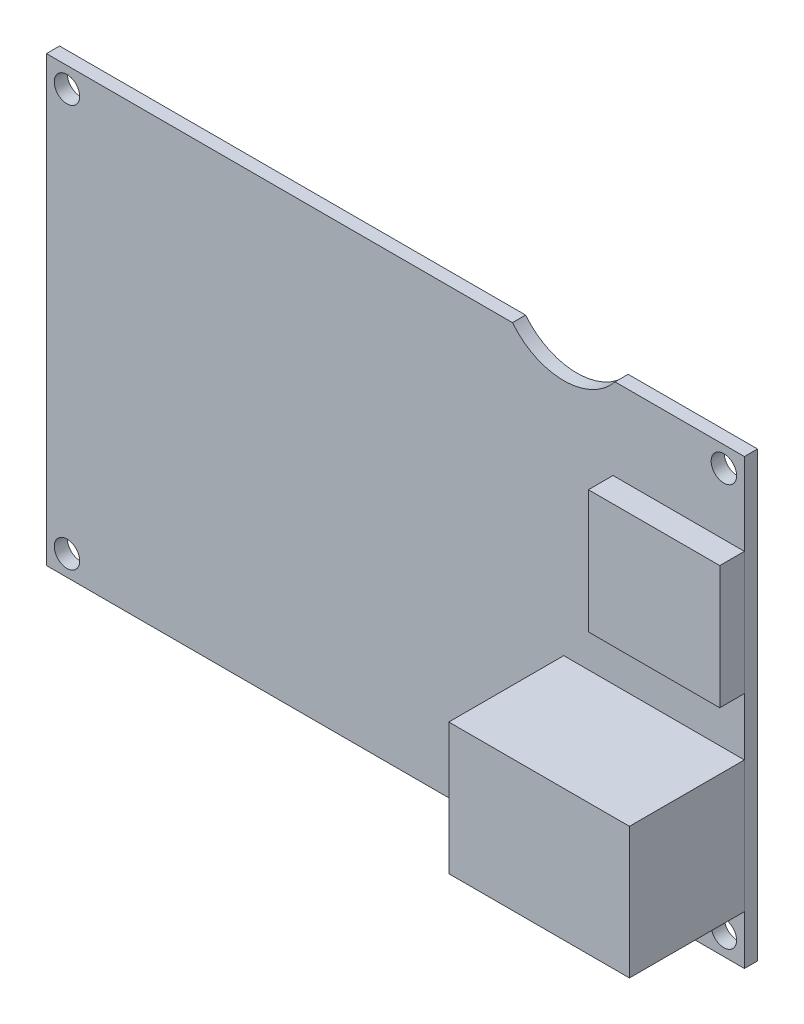
ISO-10303-21;
HEADER;
FILE_DESCRIPTION(('STEP AP214'),'2;1');
FILE_NAME('part.step','',(''),(''),'','','');
FILE_SCHEMA(('AUTOMOTIVE_DESIGN { 1 0 10303 214 1 1 1 1 }'));
ENDSEC;
DATA;
#1=APPLICATION_CONTEXT('core data for automotive mechanical design processes');
#2=APPLICATION_PROTOCOL_DEFINITION('international standard','automotive_design',2000,#1);
#3=PRODUCT_CONTEXT('',#1,'mechanical');
#4=PRODUCT('Part','Part','',(#3));
#5=PRODUCT_RELATED_PRODUCT_CATEGORY('part','',(#4));
#6=PRODUCT_DEFINITION_FORMATION('','',#4);
#7=PRODUCT_DEFINITION_CONTEXT('part definition',#1,'design');
#8=PRODUCT_DEFINITION('design','',#6,#7);
#9=PRODUCT_DEFINITION_SHAPE('','',#8);
#10=(LENGTH_UNIT() NAMED_UNIT(*) SI_UNIT(.MILLI.,.METRE.));
#11=(NAMED_UNIT(*) PLANE_ANGLE_UNIT() SI_UNIT($,.RADIAN.));
#12=(NAMED_UNIT(*) SI_UNIT($,.STERADIAN.) SOLID_ANGLE_UNIT());
#13=UNCERTAINTY_MEASURE_WITH_UNIT(LENGTH_MEASURE(1.E-05),#10,'distance_accuracy_value','');
#14=(GEOMETRIC_REPRESENTATION_CONTEXT(3) GLOBAL_UNCERTAINTY_ASSIGNED_CONTEXT((#13)) GLOBAL_UNIT_ASSIGNED_CONTEXT((#10,
#11,#12)) REPRESENTATION_CONTEXT('',''));
#15=CARTESIAN_POINT('',(0.,0.,0.));
#16=DIRECTION('',(0.,0.,1.));
#17=DIRECTION('',(1.,0.,0.));
#18=AXIS2_PLACEMENT_3D('',#15,#16,#17);
#19=CARTESIAN_POINT('',(69.,-51.469609130499,4.6));
#20=DIRECTION('',(-1.,0.,0.));
#21=DIRECTION('',(0.,0.,1.));
#22=AXIS2_PLACEMENT_3D('',#19,#20,#21);
#23=PLANE('',#22);
#24=DIRECTION('',(0.,1.,0.));
#25=VECTOR('',#24,1.);
#26=CARTESIAN_POINT('',(69.,-51.469609130499,1.6));
#27=LINE('',#26,#25);
#28=CARTESIAN_POINT('',(69.,29.,1.6));
#29=VERTEX_POINT('',#28);
#30=CARTESIAN_POINT('',(69.,44.,1.6));
#31=VERTEX_POINT('',#30);
#32=EDGE_CURVE('E108',#29,#31,#27,.T.);
#33=ORIENTED_EDGE('',*,*,#32,.F.);
#34=DIRECTION('',(0.,0.,-1.));
#35=VECTOR('',#34,1.);
#36=CARTESIAN_POINT('',(69.,29.,4.6));
#37=LINE('',#36,#35);
#38=CARTESIAN_POINT('',(69.,29.,4.6));
#39=VERTEX_POINT('',#38);
#40=EDGE_CURVE('E12',#39,#29,#37,.T.);
#41=ORIENTED_EDGE('',*,*,#40,.F.);
#42=DIRECTION('',(0.,1.,0.));
#43=VECTOR('',#42,1.);
#44=CARTESIAN_POINT('',(69.,-51.469609130499,4.6));
#45=LINE('',#44,#43);
#46=CARTESIAN_POINT('',(69.,44.,4.6));
#47=VERTEX_POINT('',#46);
#48=EDGE_CURVE('E102',#39,#47,#45,.T.);
#49=ORIENTED_EDGE('',*,*,#48,.T.);
#50=DIRECTION('',(0.,0.,-1.));
#51=VECTOR('',#50,1.);
#52=CARTESIAN_POINT('',(69.,44.,4.6));
#53=LINE('',#52,#51);
#54=EDGE_CURVE('E83',#47,#31,#53,.T.);
#55=ORIENTED_EDGE('',*,*,#54,.T.);
#56=EDGE_LOOP('',(#33,#41,#49,#55));
#57=FACE_BOUND('',#56,.T.);
#58=ADVANCED_FACE('F45',(#57),#23,.T.);
#59=CARTESIAN_POINT('',(42.5,29.,4.6));
#60=DIRECTION('',(0.,-1.,0.));
#61=DIRECTION('',(0.,0.,-1.));
#62=AXIS2_PLACEMENT_3D('',#59,#60,#61);
#63=PLANE('',#62);
#64=DIRECTION('',(-1.,0.,0.));
#65=VECTOR('',#64,1.);
#66=CARTESIAN_POINT('',(42.5,29.,1.6));
#67=LINE('',#66,#65);
#68=CARTESIAN_POINT('',(85.,29.,1.6));
#69=VERTEX_POINT('',#68);
#70=EDGE_CURVE('E96',#69,#29,#67,.T.);
#71=ORIENTED_EDGE('',*,*,#70,.F.);
#72=DIRECTION('',(0.,0.,-1.));
#73=VECTOR('',#72,1.);
#74=CARTESIAN_POINT('',(85.,29.,4.6));
#75=LINE('',#74,#73);
#76=CARTESIAN_POINT('',(85.,29.,4.6));
#77=VERTEX_POINT('',#76);
#78=EDGE_CURVE('E53',#77,#69,#75,.T.);
#79=ORIENTED_EDGE('',*,*,#78,.F.);
#80=DIRECTION('',(-1.,0.,0.));
#81=VECTOR('',#80,1.);
#82=CARTESIAN_POINT('',(42.5,29.,4.6));
#83=LINE('',#82,#81);
#84=EDGE_CURVE('E94',#77,#39,#83,.T.);
#85=ORIENTED_EDGE('',*,*,#84,.T.);
#86=ORIENTED_EDGE('',*,*,#40,.T.);
#87=EDGE_LOOP('',(#71,#79,#85,#86));
#88=FACE_BOUND('',#87,.T.);
#89=ADVANCED_FACE('F92',(#88),#63,.T.);
#90=CARTESIAN_POINT('',(85.,-51.469609130499,4.6));
#91=DIRECTION('',(-1.,0.,0.));
#92=DIRECTION('',(0.,0.,1.));
#93=AXIS2_PLACEMENT_3D('',#90,#91,#92);
#94=PLANE('',#93);
#95=DIRECTION('',(0.,1.,0.));
#96=VECTOR('',#95,1.);
#97=CARTESIAN_POINT('',(85.,-51.469609130499,1.6));
#98=LINE('',#97,#96);
#99=CARTESIAN_POINT('',(85.,44.,1.6));
#100=VERTEX_POINT('',#99);
#101=EDGE_CURVE('E76',#69,#100,#98,.T.);
#102=ORIENTED_EDGE('',*,*,#101,.T.);
#103=DIRECTION('',(0.,0.,-1.));
#104=VECTOR('',#103,1.);
#105=CARTESIAN_POINT('',(85.,44.,4.6));
#106=LINE('',#105,#104);
#107=CARTESIAN_POINT('',(85.,44.,4.6));
#108=VERTEX_POINT('',#107);
#109=EDGE_CURVE('E97',#108,#100,#106,.T.);
#110=ORIENTED_EDGE('',*,*,#109,.F.);
#111=DIRECTION('',(0.,1.,0.));
#112=VECTOR('',#111,1.);
#113=CARTESIAN_POINT('',(85.,-51.469609130499,4.6));
#114=LINE('',#113,#112);
#115=EDGE_CURVE('E98',#77,#108,#114,.T.);
#116=ORIENTED_EDGE('',*,*,#115,.F.);
#117=ORIENTED_EDGE('',*,*,#78,.T.);
#118=EDGE_LOOP('',(#102,#110,#116,#117));
#119=FACE_BOUND('',#118,.T.);
#120=ADVANCED_FACE('F99',(#119),#94,.F.);
#121=CARTESIAN_POINT('',(42.5,44.,4.6));
#122=DIRECTION('',(0.,-1.,0.));
#123=DIRECTION('',(0.,0.,-1.));
#124=AXIS2_PLACEMENT_3D('',#121,#122,#123);
#125=PLANE('',#124);
#126=DIRECTION('',(-1.,0.,0.));
#127=VECTOR('',#126,1.);
#128=CARTESIAN_POINT('',(42.5,44.,1.6));
#129=LINE('',#128,#127);
#130=EDGE_CURVE('E104',#100,#31,#129,.T.);
#131=ORIENTED_EDGE('',*,*,#130,.T.);
#132=ORIENTED_EDGE('',*,*,#54,.F.);
#133=DIRECTION('',(-1.,0.,0.));
#134=VECTOR('',#133,1.);
#135=CARTESIAN_POINT('',(42.5,44.,4.6));
#136=LINE('',#135,#134);
#137=EDGE_CURVE('E61',#108,#47,#136,.T.);
#138=ORIENTED_EDGE('',*,*,#137,.F.);
#139=ORIENTED_EDGE('',*,*,#109,.T.);
#140=EDGE_LOOP('',(#131,#132,#138,#139));
#141=FACE_BOUND('',#140,.T.);
#142=ADVANCED_FACE('F117',(#141),#125,.F.);
#143=CARTESIAN_POINT('',(42.5,-51.469609130499,4.6));
#144=DIRECTION('',(0.,0.,1.));
#145=DIRECTION('',(1.,0.,0.));
#146=AXIS2_PLACEMENT_3D('',#143,#144,#145);
#147=PLANE('',#146);
#148=ORIENTED_EDGE('',*,*,#48,.F.);
#149=ORIENTED_EDGE('',*,*,#84,.F.);
#150=ORIENTED_EDGE('',*,*,#115,.T.);
#151=ORIENTED_EDGE('',*,*,#137,.T.);
#152=EDGE_LOOP('',(#148,#149,#150,#151));
#153=FACE_BOUND('',#152,.T.);
#154=ADVANCED_FACE('F101',(#153),#147,.T.);
#155=CARTESIAN_POINT('',(42.5,-51.469609130499,1.6));
#156=DIRECTION('',(0.,0.,1.));
#157=DIRECTION('',(1.,0.,0.));
#158=AXIS2_PLACEMENT_3D('',#155,#156,#157);
#159=PLANE('',#158);
#160=ORIENTED_EDGE('',*,*,#32,.T.);
#161=ORIENTED_EDGE('',*,*,#130,.F.);
#162=ORIENTED_EDGE('',*,*,#101,.F.);
#163=ORIENTED_EDGE('',*,*,#70,.T.);
#164=EDGE_LOOP('',(#160,#161,#162,#163));
#165=FACE_BOUND('',#164,.T.);
#166=ADVANCED_FACE('F119',(#165),#159,.F.);
#167=CLOSED_SHELL('',(#58,#89,#120,#142,#154,#166));
#168=MANIFOLD_SOLID_BREP('B2',#167);
#169=CARTESIAN_POINT('',(63.,-51.469609130499,15.6));
#170=DIRECTION('',(-1.,0.,0.));
#171=DIRECTION('',(0.,0.,1.));
#172=AXIS2_PLACEMENT_3D('',#169,#170,#171);
#173=PLANE('',#172);
#174=DIRECTION('',(0.,1.,0.));
#175=VECTOR('',#174,1.);
#176=CARTESIAN_POINT('',(63.,-51.469609130499,1.6));
#177=LINE('',#176,#175);
#178=CARTESIAN_POINT('',(63.,6.,1.6));
#179=VERTEX_POINT('',#178);
#180=CARTESIAN_POINT('',(63.,22.,1.6));
#181=VERTEX_POINT('',#180);
#182=EDGE_CURVE('E243',#179,#181,#177,.T.);
#183=ORIENTED_EDGE('',*,*,#182,.F.);
#184=DIRECTION('',(0.,0.,-1.));
#185=VECTOR('',#184,1.);
#186=CARTESIAN_POINT('',(63.,6.,15.6));
#187=LINE('',#186,#185);
#188=CARTESIAN_POINT('',(63.,6.,15.6));
#189=VERTEX_POINT('',#188);
#190=EDGE_CURVE('E43',#189,#179,#187,.T.);
#191=ORIENTED_EDGE('',*,*,#190,.F.);
#192=DIRECTION('',(0.,1.,0.));
#193=VECTOR('',#192,1.);
#194=CARTESIAN_POINT('',(63.,-51.469609130499,15.6));
#195=LINE('',#194,#193);
#196=CARTESIAN_POINT('',(63.,22.,15.6));
#197=VERTEX_POINT('',#196);
#198=EDGE_CURVE('E237',#189,#197,#195,.T.);
#199=ORIENTED_EDGE('',*,*,#198,.T.);
#200=DIRECTION('',(0.,0.,-1.));
#201=VECTOR('',#200,1.);
#202=CARTESIAN_POINT('',(63.,22.,15.6));
#203=LINE('',#202,#201);
#204=EDGE_CURVE('E218',#197,#181,#203,.T.);
#205=ORIENTED_EDGE('',*,*,#204,.T.);
#206=EDGE_LOOP('',(#183,#191,#199,#205));
#207=FACE_BOUND('',#206,.T.);
#208=ADVANCED_FACE('F180',(#207),#173,.T.);
#209=CARTESIAN_POINT('',(42.5,6.,15.6));
#210=DIRECTION('',(0.,-1.,0.));
#211=DIRECTION('',(0.,0.,-1.));
#212=AXIS2_PLACEMENT_3D('',#209,#210,#211);
#213=PLANE('',#212);
#214=DIRECTION('',(-1.,0.,0.));
#215=VECTOR('',#214,1.);
#216=CARTESIAN_POINT('',(42.5,6.,1.6));
#217=LINE('',#216,#215);
#218=CARTESIAN_POINT('',(85.,6.,1.6));
#219=VERTEX_POINT('',#218);
#220=EDGE_CURVE('E231',#219,#179,#217,.T.);
#221=ORIENTED_EDGE('',*,*,#220,.F.);
#222=DIRECTION('',(0.,0.,-1.));
#223=VECTOR('',#222,1.);
#224=CARTESIAN_POINT('',(85.,6.,15.6));
#225=LINE('',#224,#223);
#226=CARTESIAN_POINT('',(85.,6.,15.6));
#227=VERTEX_POINT('',#226);
#228=EDGE_CURVE('E188',#227,#219,#225,.T.);
#229=ORIENTED_EDGE('',*,*,#228,.F.);
#230=DIRECTION('',(-1.,0.,0.));
#231=VECTOR('',#230,1.);
#232=CARTESIAN_POINT('',(42.5,6.,15.6));
#233=LINE('',#232,#231);
#234=EDGE_CURVE('E229',#227,#189,#233,.T.);
#235=ORIENTED_EDGE('',*,*,#234,.T.);
#236=ORIENTED_EDGE('',*,*,#190,.T.);
#237=EDGE_LOOP('',(#221,#229,#235,#236));
#238=FACE_BOUND('',#237,.T.);
#239=ADVANCED_FACE('F227',(#238),#213,.T.);
#240=CARTESIAN_POINT('',(85.,-51.469609130499,15.6));
#241=DIRECTION('',(-1.,0.,0.));
#242=DIRECTION('',(0.,0.,1.));
#243=AXIS2_PLACEMENT_3D('',#240,#241,#242);
#244=PLANE('',#243);
#245=DIRECTION('',(0.,1.,0.));
#246=VECTOR('',#245,1.);
#247=CARTESIAN_POINT('',(85.,-51.469609130499,1.6));
#248=LINE('',#247,#246);
#249=CARTESIAN_POINT('',(85.,22.,1.6));
#250=VERTEX_POINT('',#249);
#251=EDGE_CURVE('E211',#219,#250,#248,.T.);
#252=ORIENTED_EDGE('',*,*,#251,.T.);
#253=DIRECTION('',(0.,0.,-1.));
#254=VECTOR('',#253,1.);
#255=CARTESIAN_POINT('',(85.,22.,15.6));
#256=LINE('',#255,#254);
#257=CARTESIAN_POINT('',(85.,22.,15.6));
#258=VERTEX_POINT('',#257);
#259=EDGE_CURVE('E232',#258,#250,#256,.T.);
#260=ORIENTED_EDGE('',*,*,#259,.F.);
#261=DIRECTION('',(0.,1.,0.));
#262=VECTOR('',#261,1.);
#263=CARTESIAN_POINT('',(85.,-51.469609130499,15.6));
#264=LINE('',#263,#262);
#265=EDGE_CURVE('E233',#227,#258,#264,.T.);
#266=ORIENTED_EDGE('',*,*,#265,.F.);
#267=ORIENTED_EDGE('',*,*,#228,.T.);
#268=EDGE_LOOP('',(#252,#260,#266,#267));
#269=FACE_BOUND('',#268,.T.);
#270=ADVANCED_FACE('F234',(#269),#244,.F.);
#271=CARTESIAN_POINT('',(42.5,22.,15.6));
#272=DIRECTION('',(0.,-1.,0.));
#273=DIRECTION('',(0.,0.,-1.));
#274=AXIS2_PLACEMENT_3D('',#271,#272,#273);
#275=PLANE('',#274);
#276=DIRECTION('',(-1.,0.,0.));
#277=VECTOR('',#276,1.);
#278=CARTESIAN_POINT('',(42.5,22.,1.6));
#279=LINE('',#278,#277);
#280=EDGE_CURVE('E239',#250,#181,#279,.T.);
#281=ORIENTED_EDGE('',*,*,#280,.T.);
#282=ORIENTED_EDGE('',*,*,#204,.F.);
#283=DIRECTION('',(-1.,0.,0.));
#284=VECTOR('',#283,1.);
#285=CARTESIAN_POINT('',(42.5,22.,15.6));
#286=LINE('',#285,#284);
#287=EDGE_CURVE('E196',#258,#197,#286,.T.);
#288=ORIENTED_EDGE('',*,*,#287,.F.);
#289=ORIENTED_EDGE('',*,*,#259,.T.);
#290=EDGE_LOOP('',(#281,#282,#288,#289));
#291=FACE_BOUND('',#290,.T.);
#292=ADVANCED_FACE('F252',(#291),#275,.F.);
#293=CARTESIAN_POINT('',(42.5,-51.469609130499,15.6));
#294=DIRECTION('',(0.,0.,1.));
#295=DIRECTION('',(1.,0.,0.));
#296=AXIS2_PLACEMENT_3D('',#293,#294,#295);
#297=PLANE('',#296);
#298=ORIENTED_EDGE('',*,*,#198,.F.);
#299=ORIENTED_EDGE('',*,*,#234,.F.);
#300=ORIENTED_EDGE('',*,*,#265,.T.);
#301=ORIENTED_EDGE('',*,*,#287,.T.);
#302=EDGE_LOOP('',(#298,#299,#300,#301));
#303=FACE_BOUND('',#302,.T.);
#304=ADVANCED_FACE('F236',(#303),#297,.T.);
#305=CARTESIAN_POINT('',(42.5,-51.469609130499,1.6));
#306=DIRECTION('',(0.,0.,1.));
#307=DIRECTION('',(1.,0.,0.));
#308=AXIS2_PLACEMENT_3D('',#305,#306,#307);
#309=PLANE('',#308);
#310=ORIENTED_EDGE('',*,*,#182,.T.);
#311=ORIENTED_EDGE('',*,*,#280,.F.);
#312=ORIENTED_EDGE('',*,*,#251,.F.);
#313=ORIENTED_EDGE('',*,*,#220,.T.);
#314=EDGE_LOOP('',(#310,#311,#312,#313));
#315=FACE_BOUND('',#314,.T.);
#316=ADVANCED_FACE('F254',(#315),#309,.F.);
#317=CLOSED_SHELL('',(#208,#239,#270,#292,#304,#316));
#318=MANIFOLD_SOLID_BREP('B6',#317);
#319=CARTESIAN_POINT('',(0.,54.,1.6));
#320=DIRECTION('',(0.,0.,-1.));
#321=DIRECTION('',(-1.,0.,0.));
#322=AXIS2_PLACEMENT_3D('',#319,#320,#321);
#323=PLANE('',#322);
#324=CARTESIAN_POINT('',(2.5,2.5,1.6));
#325=DIRECTION('',(0.,0.,1.));
#326=DIRECTION('',(1.,0.,0.));
#327=AXIS2_PLACEMENT_3D('',#324,#325,#326);
#328=CIRCLE('',#327,1.55);
#329=CARTESIAN_POINT('',(4.05,2.5,1.6));
#330=VERTEX_POINT('',#329);
#331=EDGE_CURVE('E384',#330,#330,#328,.T.);
#332=ORIENTED_EDGE('',*,*,#331,.F.);
#333=EDGE_LOOP('',(#332));
#334=FACE_BOUND('',#333,.T.);
#335=CARTESIAN_POINT('',(82.5,51.5,1.6));
#336=DIRECTION('',(0.,0.,1.));
#337=DIRECTION('',(1.,0.,0.));
#338=AXIS2_PLACEMENT_3D('',#335,#336,#337);
#339=CIRCLE('',#338,1.54999999999999);
#340=CARTESIAN_POINT('',(84.05,51.5,1.6));
#341=VERTEX_POINT('',#340);
#342=EDGE_CURVE('E396',#341,#341,#339,.T.);
#343=ORIENTED_EDGE('',*,*,#342,.F.);
#344=EDGE_LOOP('',(#343));
#345=FACE_BOUND('',#344,.T.);
#346=CARTESIAN_POINT('',(2.5,51.5,1.6));
#347=DIRECTION('',(0.,0.,1.));
#348=DIRECTION('',(1.,0.,0.));
#349=AXIS2_PLACEMENT_3D('',#346,#347,#348);
#350=CIRCLE('',#349,1.55);
#351=CARTESIAN_POINT('',(4.05,51.5,1.6));
#352=VERTEX_POINT('',#351);
#353=EDGE_CURVE('E402',#352,#352,#350,.T.);
#354=ORIENTED_EDGE('',*,*,#353,.F.);
#355=EDGE_LOOP('',(#354));
#356=FACE_BOUND('',#355,.T.);
#357=CARTESIAN_POINT('',(82.5,2.5,1.6));
#358=DIRECTION('',(0.,0.,1.));
#359=DIRECTION('',(1.,0.,0.));
#360=AXIS2_PLACEMENT_3D('',#357,#358,#359);
#361=CIRCLE('',#360,1.54999999999999);
#362=CARTESIAN_POINT('',(84.05,2.5,1.6));
#363=VERTEX_POINT('',#362);
#364=EDGE_CURVE('E390',#363,#363,#361,.T.);
#365=ORIENTED_EDGE('',*,*,#364,.F.);
#366=EDGE_LOOP('',(#365));
#367=FACE_BOUND('',#366,.T.);
#368=CARTESIAN_POINT('',(63.,59.,1.6));
#369=DIRECTION('',(0.,0.,1.));
#370=DIRECTION('',(1.,0.,0.));
#371=AXIS2_PLACEMENT_3D('',#368,#369,#370);
#372=CIRCLE('',#371,8.);
#373=CARTESIAN_POINT('',(56.7550020016016,54.,1.6));
#374=VERTEX_POINT('',#373);
#375=CARTESIAN_POINT('',(69.2449979983984,54.,1.6));
#376=VERTEX_POINT('',#375);
#377=EDGE_CURVE('E321',#374,#376,#372,.T.);
#378=ORIENTED_EDGE('',*,*,#377,.F.);
#379=DIRECTION('',(-1.,0.,0.));
#380=VECTOR('',#379,1.);
#381=CARTESIAN_POINT('',(0.,54.,1.6));
#382=LINE('',#381,#380);
#383=CARTESIAN_POINT('',(0.,54.,1.6));
#384=VERTEX_POINT('',#383);
#385=EDGE_CURVE('E414',#374,#384,#382,.T.);
#386=ORIENTED_EDGE('',*,*,#385,.T.);
#387=DIRECTION('',(0.,-1.,0.));
#388=VECTOR('',#387,1.);
#389=CARTESIAN_POINT('',(0.,0.,1.6));
#390=LINE('',#389,#388);
#391=CARTESIAN_POINT('',(0.,0.,1.6));
#392=VERTEX_POINT('',#391);
#393=EDGE_CURVE('E366',#384,#392,#390,.T.);
#394=ORIENTED_EDGE('',*,*,#393,.T.);
#395=DIRECTION('',(1.,0.,0.));
#396=VECTOR('',#395,1.);
#397=CARTESIAN_POINT('',(0.,0.,1.6));
#398=LINE('',#397,#396);
#399=CARTESIAN_POINT('',(85.,0.,1.6));
#400=VERTEX_POINT('',#399);
#401=EDGE_CURVE('E410',#392,#400,#398,.T.);
#402=ORIENTED_EDGE('',*,*,#401,.T.);
#403=DIRECTION('',(0.,1.,0.));
#404=VECTOR('',#403,1.);
#405=CARTESIAN_POINT('',(85.,0.,1.6));
#406=LINE('',#405,#404);
#407=CARTESIAN_POINT('',(85.,54.,1.6));
#408=VERTEX_POINT('',#407);
#409=EDGE_CURVE('E412',#400,#408,#406,.T.);
#410=ORIENTED_EDGE('',*,*,#409,.T.);
#411=EDGE_CURVE('E415',#408,#376,#382,.T.);
#412=ORIENTED_EDGE('',*,*,#411,.T.);
#413=EDGE_LOOP('',(#378,#386,#394,#402,#410,#412));
#414=FACE_BOUND('',#413,.T.);
#415=ADVANCED_FACE('F306',(#334,#345,#356,#367,#414),#323,.F.);
#416=CARTESIAN_POINT('',(0.,54.,0.));
#417=DIRECTION('',(0.,0.,-1.));
#418=DIRECTION('',(-1.,0.,0.));
#419=AXIS2_PLACEMENT_3D('',#416,#417,#418);
#420=PLANE('',#419);
#421=CARTESIAN_POINT('',(2.5,2.5,0.));
#422=DIRECTION('',(0.,0.,1.));
#423=DIRECTION('',(1.,0.,0.));
#424=AXIS2_PLACEMENT_3D('',#421,#422,#423);
#425=CIRCLE('',#424,1.55);
#426=CARTESIAN_POINT('',(4.05,2.5,0.));
#427=VERTEX_POINT('',#426);
#428=EDGE_CURVE('E376',#427,#427,#425,.T.);
#429=ORIENTED_EDGE('',*,*,#428,.T.);
#430=EDGE_LOOP('',(#429));
#431=FACE_BOUND('',#430,.T.);
#432=CARTESIAN_POINT('',(82.5,51.5,0.));
#433=DIRECTION('',(0.,0.,1.));
#434=DIRECTION('',(1.,0.,0.));
#435=AXIS2_PLACEMENT_3D('',#432,#433,#434);
#436=CIRCLE('',#435,1.54999999999999);
#437=CARTESIAN_POINT('',(84.05,51.5,0.));
#438=VERTEX_POINT('',#437);
#439=EDGE_CURVE('E393',#438,#438,#436,.T.);
#440=ORIENTED_EDGE('',*,*,#439,.T.);
#441=EDGE_LOOP('',(#440));
#442=FACE_BOUND('',#441,.T.);
#443=CARTESIAN_POINT('',(2.5,51.5,0.));
#444=DIRECTION('',(0.,0.,1.));
#445=DIRECTION('',(1.,0.,0.));
#446=AXIS2_PLACEMENT_3D('',#443,#444,#445);
#447=CIRCLE('',#446,1.55);
#448=CARTESIAN_POINT('',(4.05,51.5,0.));
#449=VERTEX_POINT('',#448);
#450=EDGE_CURVE('E399',#449,#449,#447,.T.);
#451=ORIENTED_EDGE('',*,*,#450,.T.);
#452=EDGE_LOOP('',(#451));
#453=FACE_BOUND('',#452,.T.);
#454=CARTESIAN_POINT('',(82.5,2.5,0.));
#455=DIRECTION('',(0.,0.,1.));
#456=DIRECTION('',(1.,0.,0.));
#457=AXIS2_PLACEMENT_3D('',#454,#455,#456);
#458=CIRCLE('',#457,1.54999999999999);
#459=CARTESIAN_POINT('',(84.05,2.5,0.));
#460=VERTEX_POINT('',#459);
#461=EDGE_CURVE('E387',#460,#460,#458,.T.);
#462=ORIENTED_EDGE('',*,*,#461,.T.);
#463=EDGE_LOOP('',(#462));
#464=FACE_BOUND('',#463,.T.);
#465=DIRECTION('',(-1.,0.,0.));
#466=VECTOR('',#465,1.);
#467=CARTESIAN_POINT('',(0.,54.,0.));
#468=LINE('',#467,#466);
#469=CARTESIAN_POINT('',(56.7550020016016,54.,0.));
#470=VERTEX_POINT('',#469);
#471=CARTESIAN_POINT('',(0.,54.,0.));
#472=VERTEX_POINT('',#471);
#473=EDGE_CURVE('E367',#470,#472,#468,.T.);
#474=ORIENTED_EDGE('',*,*,#473,.F.);
#475=CARTESIAN_POINT('',(63.,59.,0.));
#476=DIRECTION('',(0.,0.,-1.));
#477=DIRECTION('',(-1.,0.,0.));
#478=AXIS2_PLACEMENT_3D('',#475,#476,#477);
#479=CIRCLE('',#478,8.);
#480=CARTESIAN_POINT('',(69.2449979983984,54.,0.));
#481=VERTEX_POINT('',#480);
#482=EDGE_CURVE('E371',#470,#481,#479,.F.);
#483=ORIENTED_EDGE('',*,*,#482,.T.);
#484=CARTESIAN_POINT('',(85.,54.,0.));
#485=VERTEX_POINT('',#484);
#486=EDGE_CURVE('E359',#485,#481,#468,.T.);
#487=ORIENTED_EDGE('',*,*,#486,.F.);
#488=DIRECTION('',(0.,1.,0.));
#489=VECTOR('',#488,1.);
#490=CARTESIAN_POINT('',(85.,0.,0.));
#491=LINE('',#490,#489);
#492=CARTESIAN_POINT('',(85.,0.,0.));
#493=VERTEX_POINT('',#492);
#494=EDGE_CURVE('E422',#493,#485,#491,.T.);
#495=ORIENTED_EDGE('',*,*,#494,.F.);
#496=DIRECTION('',(1.,0.,0.));
#497=VECTOR('',#496,1.);
#498=CARTESIAN_POINT('',(0.,0.,0.));
#499=LINE('',#498,#497);
#500=CARTESIAN_POINT('',(0.,0.,0.));
#501=VERTEX_POINT('',#500);
#502=EDGE_CURVE('E420',#501,#493,#499,.T.);
#503=ORIENTED_EDGE('',*,*,#502,.F.);
#504=DIRECTION('',(0.,-1.,0.));
#505=VECTOR('',#504,1.);
#506=CARTESIAN_POINT('',(0.,0.,0.));
#507=LINE('',#506,#505);
#508=EDGE_CURVE('E405',#472,#501,#507,.T.);
#509=ORIENTED_EDGE('',*,*,#508,.F.);
#510=EDGE_LOOP('',(#474,#483,#487,#495,#503,#509));
#511=FACE_BOUND('',#510,.T.);
#512=ADVANCED_FACE('F372',(#431,#442,#453,#464,#511),#420,.T.);
#513=CARTESIAN_POINT('',(0.,54.,1.6));
#514=DIRECTION('',(0.,-1.,0.));
#515=DIRECTION('',(0.,0.,-1.));
#516=AXIS2_PLACEMENT_3D('',#513,#514,#515);
#517=PLANE('',#516);
#518=DIRECTION('',(0.,0.,-1.));
#519=VECTOR('',#518,1.);
#520=CARTESIAN_POINT('',(56.7550020016016,54.,1.6));
#521=LINE('',#520,#519);
#522=EDGE_CURVE('E380',#374,#470,#521,.T.);
#523=ORIENTED_EDGE('',*,*,#522,.T.);
#524=ORIENTED_EDGE('',*,*,#473,.T.);
#525=DIRECTION('',(0.,0.,-1.));
#526=VECTOR('',#525,1.);
#527=CARTESIAN_POINT('',(0.,54.,1.6));
#528=LINE('',#527,#526);
#529=EDGE_CURVE('E417',#384,#472,#528,.T.);
#530=ORIENTED_EDGE('',*,*,#529,.F.);
#531=ORIENTED_EDGE('',*,*,#385,.F.);
#532=EDGE_LOOP('',(#523,#524,#530,#531));
#533=FACE_BOUND('',#532,.T.);
#534=ADVANCED_FACE('F438',(#533),#517,.F.);
#535=DIRECTION('',(0.,0.,-1.));
#536=VECTOR('',#535,1.);
#537=CARTESIAN_POINT('',(69.2449979983984,54.,1.6));
#538=LINE('',#537,#536);
#539=EDGE_CURVE('E329',#376,#481,#538,.T.);
#540=ORIENTED_EDGE('',*,*,#539,.F.);
#541=ORIENTED_EDGE('',*,*,#411,.F.);
#542=DIRECTION('',(0.,0.,-1.));
#543=VECTOR('',#542,1.);
#544=CARTESIAN_POINT('',(85.,54.,1.6));
#545=LINE('',#544,#543);
#546=EDGE_CURVE('E363',#408,#485,#545,.T.);
#547=ORIENTED_EDGE('',*,*,#546,.T.);
#548=ORIENTED_EDGE('',*,*,#486,.T.);
#549=EDGE_LOOP('',(#540,#541,#547,#548));
#550=FACE_BOUND('',#549,.T.);
#551=ADVANCED_FACE('F361',(#550),#517,.F.);
#552=CARTESIAN_POINT('',(0.,0.,1.6));
#553=DIRECTION('',(1.,0.,0.));
#554=DIRECTION('',(0.,0.,-1.));
#555=AXIS2_PLACEMENT_3D('',#552,#553,#554);
#556=PLANE('',#555);
#557=ORIENTED_EDGE('',*,*,#508,.T.);
#558=DIRECTION('',(0.,0.,-1.));
#559=VECTOR('',#558,1.);
#560=CARTESIAN_POINT('',(0.,0.,1.6));
#561=LINE('',#560,#559);
#562=EDGE_CURVE('E178',#392,#501,#561,.T.);
#563=ORIENTED_EDGE('',*,*,#562,.F.);
#564=ORIENTED_EDGE('',*,*,#393,.F.);
#565=ORIENTED_EDGE('',*,*,#529,.T.);
#566=EDGE_LOOP('',(#557,#563,#564,#565));
#567=FACE_BOUND('',#566,.T.);
#568=ADVANCED_FACE('F308',(#567),#556,.F.);
#569=CARTESIAN_POINT('',(0.,0.,1.6));
#570=DIRECTION('',(0.,1.,0.));
#571=DIRECTION('',(0.,0.,1.));
#572=AXIS2_PLACEMENT_3D('',#569,#570,#571);
#573=PLANE('',#572);
#574=ORIENTED_EDGE('',*,*,#502,.T.);
#575=DIRECTION('',(0.,0.,-1.));
#576=VECTOR('',#575,1.);
#577=CARTESIAN_POINT('',(85.,0.,1.6));
#578=LINE('',#577,#576);
#579=EDGE_CURVE('E314',#400,#493,#578,.T.);
#580=ORIENTED_EDGE('',*,*,#579,.F.);
#581=ORIENTED_EDGE('',*,*,#401,.F.);
#582=ORIENTED_EDGE('',*,*,#562,.T.);
#583=EDGE_LOOP('',(#574,#580,#581,#582));
#584=FACE_BOUND('',#583,.T.);
#585=ADVANCED_FACE('F433',(#584),#573,.F.);
#586=CARTESIAN_POINT('',(85.,0.,1.6));
#587=DIRECTION('',(-1.,0.,0.));
#588=DIRECTION('',(0.,0.,1.));
#589=AXIS2_PLACEMENT_3D('',#586,#587,#588);
#590=PLANE('',#589);
#591=ORIENTED_EDGE('',*,*,#494,.T.);
#592=ORIENTED_EDGE('',*,*,#546,.F.);
#593=ORIENTED_EDGE('',*,*,#409,.F.);
#594=ORIENTED_EDGE('',*,*,#579,.T.);
#595=EDGE_LOOP('',(#591,#592,#593,#594));
#596=FACE_BOUND('',#595,.T.);
#597=ADVANCED_FACE('F430',(#596),#590,.F.);
#598=CARTESIAN_POINT('',(2.5,51.5,1.6));
#599=DIRECTION('',(0.,0.,-1.));
#600=DIRECTION('',(-1.,0.,0.));
#601=AXIS2_PLACEMENT_3D('',#598,#599,#600);
#602=CYLINDRICAL_SURFACE('',#601,1.55);
#603=ORIENTED_EDGE('',*,*,#353,.T.);
#604=EDGE_LOOP('',(#603));
#605=FACE_BOUND('',#604,.T.);
#606=ORIENTED_EDGE('',*,*,#450,.F.);
#607=EDGE_LOOP('',(#606));
#608=FACE_BOUND('',#607,.T.);
#609=ADVANCED_FACE('F451',(#605,#608),#602,.F.);
#610=CARTESIAN_POINT('',(82.5,51.5,1.6));
#611=DIRECTION('',(0.,0.,-1.));
#612=DIRECTION('',(-1.,0.,0.));
#613=AXIS2_PLACEMENT_3D('',#610,#611,#612);
#614=CYLINDRICAL_SURFACE('',#613,1.54999999999999);
#615=ORIENTED_EDGE('',*,*,#342,.T.);
#616=EDGE_LOOP('',(#615));
#617=FACE_BOUND('',#616,.T.);
#618=ORIENTED_EDGE('',*,*,#439,.F.);
#619=EDGE_LOOP('',(#618));
#620=FACE_BOUND('',#619,.T.);
#621=ADVANCED_FACE('F505',(#617,#620),#614,.F.);
#622=CARTESIAN_POINT('',(82.5,2.5,1.6));
#623=DIRECTION('',(0.,0.,-1.));
#624=DIRECTION('',(-1.,0.,0.));
#625=AXIS2_PLACEMENT_3D('',#622,#623,#624);
#626=CYLINDRICAL_SURFACE('',#625,1.54999999999999);
#627=ORIENTED_EDGE('',*,*,#364,.T.);
#628=EDGE_LOOP('',(#627));
#629=FACE_BOUND('',#628,.T.);
#630=ORIENTED_EDGE('',*,*,#461,.F.);
#631=EDGE_LOOP('',(#630));
#632=FACE_BOUND('',#631,.T.);
#633=ADVANCED_FACE('F498',(#629,#632),#626,.F.);
#634=CARTESIAN_POINT('',(2.5,2.5,1.6));
#635=DIRECTION('',(0.,0.,-1.));
#636=DIRECTION('',(-1.,0.,0.));
#637=AXIS2_PLACEMENT_3D('',#634,#635,#636);
#638=CYLINDRICAL_SURFACE('',#637,1.55);
#639=ORIENTED_EDGE('',*,*,#331,.T.);
#640=EDGE_LOOP('',(#639));
#641=FACE_BOUND('',#640,.T.);
#642=ORIENTED_EDGE('',*,*,#428,.F.);
#643=EDGE_LOOP('',(#642));
#644=FACE_BOUND('',#643,.T.);
#645=ADVANCED_FACE('F476',(#641,#644),#638,.F.);
#646=CARTESIAN_POINT('',(63.,59.,1.6));
#647=DIRECTION('',(0.,0.,-1.));
#648=DIRECTION('',(-1.,0.,0.));
#649=AXIS2_PLACEMENT_3D('',#646,#647,#648);
#650=CYLINDRICAL_SURFACE('',#649,8.);
#651=ORIENTED_EDGE('',*,*,#482,.F.);
#652=ORIENTED_EDGE('',*,*,#522,.F.);
#653=ORIENTED_EDGE('',*,*,#377,.T.);
#654=ORIENTED_EDGE('',*,*,#539,.T.);
#655=EDGE_LOOP('',(#651,#652,#653,#654));
#656=FACE_BOUND('',#655,.T.);
#657=ADVANCED_FACE('F378',(#656),#650,.F.);
#658=CLOSED_SHELL('',(#415,#512,#534,#551,#568,#585,#597,#609,#621,#633,#645,#657));
#659=MANIFOLD_SOLID_BREP('B37',#658);
#660=ADVANCED_BREP_SHAPE_REPRESENTATION('',(#18,#168,#318,#659),#14);
#661=SHAPE_DEFINITION_REPRESENTATION(#9,#660);
ENDSEC;
END-ISO-10303-21;
